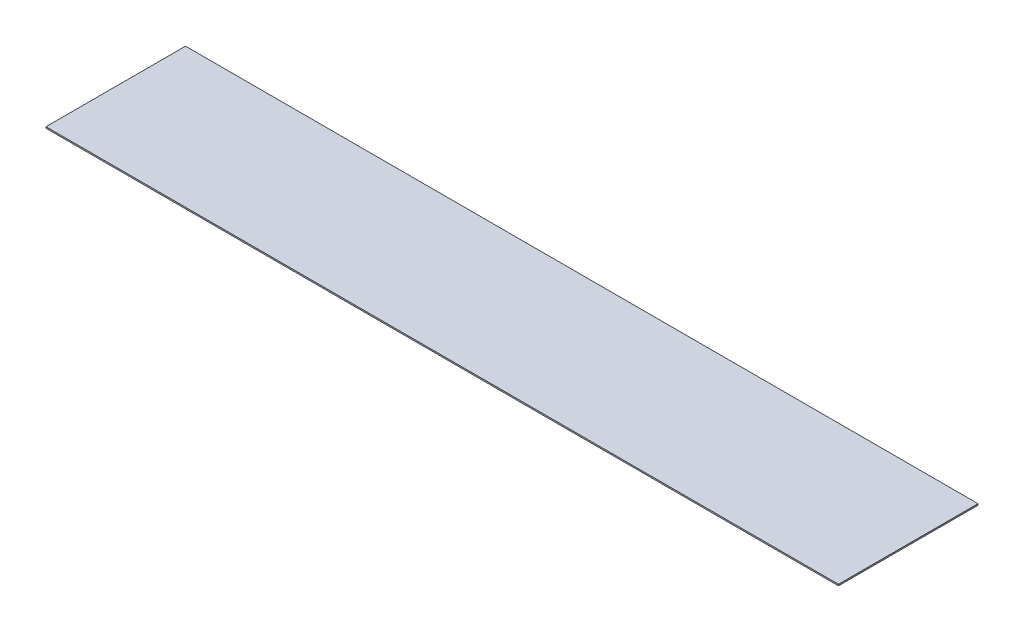
ISO-10303-21;
HEADER;
FILE_DESCRIPTION(('STEP AP214'),'2;1');
FILE_NAME('part.step','',(''),(''),'','','');
FILE_SCHEMA(('AUTOMOTIVE_DESIGN { 1 0 10303 214 1 1 1 1 }'));
ENDSEC;
DATA;
#1=APPLICATION_CONTEXT('core data for automotive mechanical design processes');
#2=APPLICATION_PROTOCOL_DEFINITION('international standard','automotive_design',2000,#1);
#3=PRODUCT_CONTEXT('',#1,'mechanical');
#4=PRODUCT('Part','Part','',(#3));
#5=PRODUCT_RELATED_PRODUCT_CATEGORY('part','',(#4));
#6=PRODUCT_DEFINITION_FORMATION('','',#4);
#7=PRODUCT_DEFINITION_CONTEXT('part definition',#1,'design');
#8=PRODUCT_DEFINITION('design','',#6,#7);
#9=PRODUCT_DEFINITION_SHAPE('','',#8);
#10=(LENGTH_UNIT() NAMED_UNIT(*) SI_UNIT(.MILLI.,.METRE.));
#11=(NAMED_UNIT(*) PLANE_ANGLE_UNIT() SI_UNIT($,.RADIAN.));
#12=(NAMED_UNIT(*) SI_UNIT($,.STERADIAN.) SOLID_ANGLE_UNIT());
#13=UNCERTAINTY_MEASURE_WITH_UNIT(LENGTH_MEASURE(1.E-05),#10,'distance_accuracy_value','');
#14=(GEOMETRIC_REPRESENTATION_CONTEXT(3) GLOBAL_UNCERTAINTY_ASSIGNED_CONTEXT((#13)) GLOBAL_UNIT_ASSIGNED_CONTEXT((#10,
#11,#12)) REPRESENTATION_CONTEXT('',''));
#15=CARTESIAN_POINT('',(0.,0.,0.));
#16=DIRECTION('',(0.,0.,1.));
#17=DIRECTION('',(1.,0.,0.));
#18=AXIS2_PLACEMENT_3D('',#15,#16,#17);
#19=CARTESIAN_POINT('',(2840.,10.,500.));
#20=DIRECTION('',(-1.,0.,0.));
#21=DIRECTION('',(0.,0.,1.));
#22=AXIS2_PLACEMENT_3D('',#19,#20,#21);
#23=PLANE('',#22);
#24=DIRECTION('',(0.,0.,-1.));
#25=VECTOR('',#24,1.);
#26=CARTESIAN_POINT('',(2840.,0.,500.));
#27=LINE('',#26,#25);
#28=CARTESIAN_POINT('',(2840.,0.,500.));
#29=VERTEX_POINT('',#28);
#30=CARTESIAN_POINT('',(2840.,0.,-500.));
#31=VERTEX_POINT('',#30);
#32=EDGE_CURVE('E96',#29,#31,#27,.T.);
#33=ORIENTED_EDGE('',*,*,#32,.T.);
#34=DIRECTION('',(0.,-1.,0.));
#35=VECTOR('',#34,1.);
#36=CARTESIAN_POINT('',(2840.,10.,-500.));
#37=LINE('',#36,#35);
#38=CARTESIAN_POINT('',(2840.,10.,-500.));
#39=VERTEX_POINT('',#38);
#40=EDGE_CURVE('E11',#39,#31,#37,.T.);
#41=ORIENTED_EDGE('',*,*,#40,.F.);
#42=DIRECTION('',(0.,0.,-1.));
#43=VECTOR('',#42,1.);
#44=CARTESIAN_POINT('',(2840.,10.,500.));
#45=LINE('',#44,#43);
#46=CARTESIAN_POINT('',(2840.,10.,500.));
#47=VERTEX_POINT('',#46);
#48=EDGE_CURVE('E84',#47,#39,#45,.T.);
#49=ORIENTED_EDGE('',*,*,#48,.F.);
#50=DIRECTION('',(0.,-1.,0.));
#51=VECTOR('',#50,1.);
#52=CARTESIAN_POINT('',(2840.,10.,500.));
#53=LINE('',#52,#51);
#54=EDGE_CURVE('E92',#47,#29,#53,.T.);
#55=ORIENTED_EDGE('',*,*,#54,.T.);
#56=EDGE_LOOP('',(#33,#41,#49,#55));
#57=FACE_BOUND('',#56,.T.);
#58=ADVANCED_FACE('F33',(#57),#23,.F.);
#59=CARTESIAN_POINT('',(-2840.,10.,-500.));
#60=DIRECTION('',(0.,0.,1.));
#61=DIRECTION('',(1.,0.,0.));
#62=AXIS2_PLACEMENT_3D('',#59,#60,#61);
#63=PLANE('',#62);
#64=DIRECTION('',(-1.,0.,0.));
#65=VECTOR('',#64,1.);
#66=CARTESIAN_POINT('',(-2840.,0.,-500.));
#67=LINE('',#66,#65);
#68=CARTESIAN_POINT('',(-2840.,0.,-500.));
#69=VERTEX_POINT('',#68);
#70=EDGE_CURVE('E88',#31,#69,#67,.T.);
#71=ORIENTED_EDGE('',*,*,#70,.T.);
#72=DIRECTION('',(0.,-1.,0.));
#73=VECTOR('',#72,1.);
#74=CARTESIAN_POINT('',(-2840.,10.,-500.));
#75=LINE('',#74,#73);
#76=CARTESIAN_POINT('',(-2840.,10.,-500.));
#77=VERTEX_POINT('',#76);
#78=EDGE_CURVE('E41',#77,#69,#75,.T.);
#79=ORIENTED_EDGE('',*,*,#78,.F.);
#80=DIRECTION('',(-1.,0.,0.));
#81=VECTOR('',#80,1.);
#82=CARTESIAN_POINT('',(-2840.,10.,-500.));
#83=LINE('',#82,#81);
#84=EDGE_CURVE('E79',#39,#77,#83,.T.);
#85=ORIENTED_EDGE('',*,*,#84,.F.);
#86=ORIENTED_EDGE('',*,*,#40,.T.);
#87=EDGE_LOOP('',(#71,#79,#85,#86));
#88=FACE_BOUND('',#87,.T.);
#89=ADVANCED_FACE('F87',(#88),#63,.F.);
#90=CARTESIAN_POINT('',(-2840.,10.,500.));
#91=DIRECTION('',(1.,0.,0.));
#92=DIRECTION('',(0.,0.,-1.));
#93=AXIS2_PLACEMENT_3D('',#90,#91,#92);
#94=PLANE('',#93);
#95=DIRECTION('',(0.,0.,1.));
#96=VECTOR('',#95,1.);
#97=CARTESIAN_POINT('',(-2840.,0.,500.));
#98=LINE('',#97,#96);
#99=CARTESIAN_POINT('',(-2840.,0.,500.));
#100=VERTEX_POINT('',#99);
#101=EDGE_CURVE('E66',#69,#100,#98,.T.);
#102=ORIENTED_EDGE('',*,*,#101,.T.);
#103=DIRECTION('',(0.,-1.,0.));
#104=VECTOR('',#103,1.);
#105=CARTESIAN_POINT('',(-2840.,10.,500.));
#106=LINE('',#105,#104);
#107=CARTESIAN_POINT('',(-2840.,10.,500.));
#108=VERTEX_POINT('',#107);
#109=EDGE_CURVE('E89',#108,#100,#106,.T.);
#110=ORIENTED_EDGE('',*,*,#109,.F.);
#111=DIRECTION('',(0.,0.,1.));
#112=VECTOR('',#111,1.);
#113=CARTESIAN_POINT('',(-2840.,10.,500.));
#114=LINE('',#113,#112);
#115=EDGE_CURVE('E82',#77,#108,#114,.T.);
#116=ORIENTED_EDGE('',*,*,#115,.F.);
#117=ORIENTED_EDGE('',*,*,#78,.T.);
#118=EDGE_LOOP('',(#102,#110,#116,#117));
#119=FACE_BOUND('',#118,.T.);
#120=ADVANCED_FACE('F90',(#119),#94,.F.);
#121=CARTESIAN_POINT('',(-2840.,10.,500.));
#122=DIRECTION('',(0.,0.,-1.));
#123=DIRECTION('',(-1.,0.,0.));
#124=AXIS2_PLACEMENT_3D('',#121,#122,#123);
#125=PLANE('',#124);
#126=DIRECTION('',(1.,0.,0.));
#127=VECTOR('',#126,1.);
#128=CARTESIAN_POINT('',(-2840.,0.,500.));
#129=LINE('',#128,#127);
#130=EDGE_CURVE('E72',#100,#29,#129,.T.);
#131=ORIENTED_EDGE('',*,*,#130,.T.);
#132=ORIENTED_EDGE('',*,*,#54,.F.);
#133=DIRECTION('',(1.,0.,0.));
#134=VECTOR('',#133,1.);
#135=CARTESIAN_POINT('',(-2840.,10.,500.));
#136=LINE('',#135,#134);
#137=EDGE_CURVE('E49',#108,#47,#136,.T.);
#138=ORIENTED_EDGE('',*,*,#137,.F.);
#139=ORIENTED_EDGE('',*,*,#109,.T.);
#140=EDGE_LOOP('',(#131,#132,#138,#139));
#141=FACE_BOUND('',#140,.T.);
#142=ADVANCED_FACE('F103',(#141),#125,.F.);
#143=CARTESIAN_POINT('',(0.,10.,0.));
#144=DIRECTION('',(0.,-1.,0.));
#145=DIRECTION('',(0.,0.,-1.));
#146=AXIS2_PLACEMENT_3D('',#143,#144,#145);
#147=PLANE('',#146);
#148=ORIENTED_EDGE('',*,*,#48,.T.);
#149=ORIENTED_EDGE('',*,*,#84,.T.);
#150=ORIENTED_EDGE('',*,*,#115,.T.);
#151=ORIENTED_EDGE('',*,*,#137,.T.);
#152=EDGE_LOOP('',(#148,#149,#150,#151));
#153=FACE_BOUND('',#152,.T.);
#154=ADVANCED_FACE('F80',(#153),#147,.F.);
#155=CARTESIAN_POINT('',(0.,0.,0.));
#156=DIRECTION('',(0.,-1.,0.));
#157=DIRECTION('',(0.,0.,-1.));
#158=AXIS2_PLACEMENT_3D('',#155,#156,#157);
#159=PLANE('',#158);
#160=ORIENTED_EDGE('',*,*,#32,.F.);
#161=ORIENTED_EDGE('',*,*,#130,.F.);
#162=ORIENTED_EDGE('',*,*,#101,.F.);
#163=ORIENTED_EDGE('',*,*,#70,.F.);
#164=EDGE_LOOP('',(#160,#161,#162,#163));
#165=FACE_BOUND('',#164,.T.);
#166=ADVANCED_FACE('F106',(#165),#159,.T.);
#167=CLOSED_SHELL('',(#58,#89,#120,#142,#154,#166));
#168=MANIFOLD_SOLID_BREP('B2',#167);
#169=ADVANCED_BREP_SHAPE_REPRESENTATION('',(#18,#168),#14);
#170=SHAPE_DEFINITION_REPRESENTATION(#9,#169);
ENDSEC;
END-ISO-10303-21;
